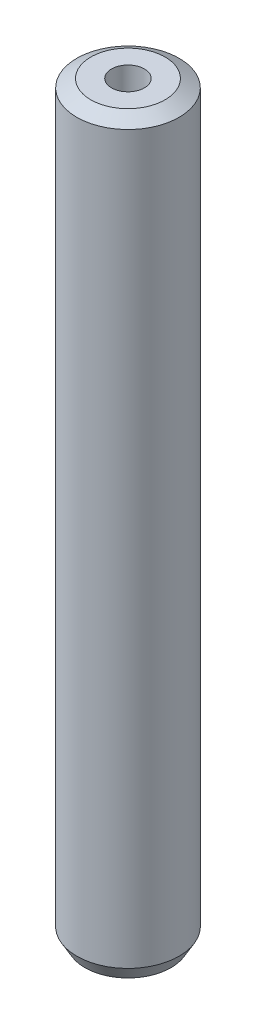
ISO-10303-21;
HEADER;
FILE_DESCRIPTION(('STEP AP214'),'2;1');
FILE_NAME('part.step','',(''),(''),'','','');
FILE_SCHEMA(('AUTOMOTIVE_DESIGN { 1 0 10303 214 1 1 1 1 }'));
ENDSEC;
DATA;
#1=APPLICATION_CONTEXT('core data for automotive mechanical design processes');
#2=APPLICATION_PROTOCOL_DEFINITION('international standard','automotive_design',2000,#1);
#3=PRODUCT_CONTEXT('',#1,'mechanical');
#4=PRODUCT('Part','Part','',(#3));
#5=PRODUCT_RELATED_PRODUCT_CATEGORY('part','',(#4));
#6=PRODUCT_DEFINITION_FORMATION('','',#4);
#7=PRODUCT_DEFINITION_CONTEXT('part definition',#1,'design');
#8=PRODUCT_DEFINITION('design','',#6,#7);
#9=PRODUCT_DEFINITION_SHAPE('','',#8);
#10=(LENGTH_UNIT() NAMED_UNIT(*) SI_UNIT(.MILLI.,.METRE.));
#11=(NAMED_UNIT(*) PLANE_ANGLE_UNIT() SI_UNIT($,.RADIAN.));
#12=(NAMED_UNIT(*) SI_UNIT($,.STERADIAN.) SOLID_ANGLE_UNIT());
#13=UNCERTAINTY_MEASURE_WITH_UNIT(LENGTH_MEASURE(1.E-05),#10,'distance_accuracy_value','');
#14=(GEOMETRIC_REPRESENTATION_CONTEXT(3) GLOBAL_UNCERTAINTY_ASSIGNED_CONTEXT((#13)) GLOBAL_UNIT_ASSIGNED_CONTEXT((#10,
#11,#12)) REPRESENTATION_CONTEXT('',''));
#15=CARTESIAN_POINT('',(0.,0.,0.));
#16=DIRECTION('',(0.,0.,1.));
#17=DIRECTION('',(1.,0.,0.));
#18=AXIS2_PLACEMENT_3D('',#15,#16,#17);
#19=CARTESIAN_POINT('',(0.,365.803524565101,0.));
#20=DIRECTION('',(0.,-1.,0.));
#21=DIRECTION('',(0.,0.,-1.));
#22=AXIS2_PLACEMENT_3D('',#19,#20,#21);
#23=CYLINDRICAL_SURFACE('',#22,25.);
#24=CARTESIAN_POINT('',(0.,361.839839552045,0.));
#25=DIRECTION('',(0.,1.,0.));
#26=DIRECTION('',(0.,0.,1.));
#27=AXIS2_PLACEMENT_3D('',#24,#25,#26);
#28=CIRCLE('',#27,25.);
#29=CARTESIAN_POINT('',(0.,361.839839552045,25.));
#30=VERTEX_POINT('',#29);
#31=EDGE_CURVE('E50',#30,#30,#28,.F.);
#32=ORIENTED_EDGE('',*,*,#31,.T.);
#33=EDGE_LOOP('',(#32));
#34=FACE_BOUND('',#33,.T.);
#35=CARTESIAN_POINT('',(0.,6.86530382781253,0.));
#36=DIRECTION('',(0.,1.,0.));
#37=DIRECTION('',(0.,0.,1.));
#38=AXIS2_PLACEMENT_3D('',#35,#36,#37);
#39=CIRCLE('',#38,25.);
#40=CARTESIAN_POINT('',(0.,6.86530382781253,25.));
#41=VERTEX_POINT('',#40);
#42=EDGE_CURVE('E51',#41,#41,#39,.T.);
#43=ORIENTED_EDGE('',*,*,#42,.T.);
#44=EDGE_LOOP('',(#43));
#45=FACE_BOUND('',#44,.T.);
#46=ADVANCED_FACE('F39',(#34,#45),#23,.T.);
#47=CARTESIAN_POINT('',(0.,365.803524565101,0.));
#48=DIRECTION('',(0.,1.,0.));
#49=DIRECTION('',(0.,0.,1.));
#50=AXIS2_PLACEMENT_3D('',#47,#48,#49);
#51=PLANE('',#50);
#52=CARTESIAN_POINT('',(0.,365.803524565101,0.));
#53=DIRECTION('',(0.,1.,0.));
#54=DIRECTION('',(0.,0.,1.));
#55=AXIS2_PLACEMENT_3D('',#52,#53,#54);
#56=CIRCLE('',#55,18.1346961721875);
#57=CARTESIAN_POINT('',(0.,365.803524565101,18.1346961721875));
#58=VERTEX_POINT('',#57);
#59=EDGE_CURVE('E54',#58,#58,#56,.T.);
#60=ORIENTED_EDGE('',*,*,#59,.T.);
#61=EDGE_LOOP('',(#60));
#62=FACE_BOUND('',#61,.T.);
#63=CARTESIAN_POINT('',(0.,365.803524565101,0.));
#64=DIRECTION('',(0.,1.,0.));
#65=DIRECTION('',(0.,0.,1.));
#66=AXIS2_PLACEMENT_3D('',#63,#64,#65);
#67=CIRCLE('',#66,8.03740332373562);
#68=CARTESIAN_POINT('',(0.,365.803524565101,8.03740332373562));
#69=VERTEX_POINT('',#68);
#70=EDGE_CURVE('E58',#69,#69,#67,.T.);
#71=ORIENTED_EDGE('',*,*,#70,.F.);
#72=EDGE_LOOP('',(#71));
#73=FACE_BOUND('',#72,.T.);
#74=ADVANCED_FACE('F69',(#62,#73),#51,.T.);
#75=CARTESIAN_POINT('',(0.,0.,0.));
#76=DIRECTION('',(0.,1.,0.));
#77=DIRECTION('',(0.,0.,1.));
#78=AXIS2_PLACEMENT_3D('',#75,#76,#77);
#79=PLANE('',#78);
#80=CARTESIAN_POINT('',(0.,0.,0.));
#81=DIRECTION('',(0.,1.,0.));
#82=DIRECTION('',(0.,0.,1.));
#83=AXIS2_PLACEMENT_3D('',#80,#81,#82);
#84=CIRCLE('',#83,21.0363149869439);
#85=CARTESIAN_POINT('',(0.,0.,21.0363149869439));
#86=VERTEX_POINT('',#85);
#87=EDGE_CURVE('E10',#86,#86,#84,.F.);
#88=ORIENTED_EDGE('',*,*,#87,.T.);
#89=EDGE_LOOP('',(#88));
#90=FACE_BOUND('',#89,.T.);
#91=CARTESIAN_POINT('',(0.,0.,0.));
#92=DIRECTION('',(0.,1.,0.));
#93=DIRECTION('',(0.,0.,1.));
#94=AXIS2_PLACEMENT_3D('',#91,#92,#93);
#95=CIRCLE('',#94,8.03740332373562);
#96=CARTESIAN_POINT('',(0.,0.,8.03740332373562));
#97=VERTEX_POINT('',#96);
#98=EDGE_CURVE('E63',#97,#97,#95,.T.);
#99=ORIENTED_EDGE('',*,*,#98,.T.);
#100=EDGE_LOOP('',(#99));
#101=FACE_BOUND('',#100,.T.);
#102=ADVANCED_FACE('F75',(#90,#101),#79,.F.);
#103=CARTESIAN_POINT('',(0.,365.803524565101,0.));
#104=DIRECTION('',(0.,-1.,0.));
#105=DIRECTION('',(0.,0.,-1.));
#106=AXIS2_PLACEMENT_3D('',#103,#104,#105);
#107=CYLINDRICAL_SURFACE('',#106,8.03740332373562);
#108=ORIENTED_EDGE('',*,*,#70,.T.);
#109=EDGE_LOOP('',(#108));
#110=FACE_BOUND('',#109,.T.);
#111=ORIENTED_EDGE('',*,*,#98,.F.);
#112=EDGE_LOOP('',(#111));
#113=FACE_BOUND('',#112,.T.);
#114=ADVANCED_FACE('F70',(#110,#113),#107,.F.);
#115=CARTESIAN_POINT('',(0.,365.803524565101,0.));
#116=DIRECTION('',(0.,-1.,0.));
#117=DIRECTION('',(0.,0.,-1.));
#118=AXIS2_PLACEMENT_3D('',#115,#116,#117);
#119=CONICAL_SURFACE('',#118,18.1346961721875,1.04719755119659);
#120=ORIENTED_EDGE('',*,*,#31,.F.);
#121=EDGE_LOOP('',(#120));
#122=FACE_BOUND('',#121,.T.);
#123=ORIENTED_EDGE('',*,*,#59,.F.);
#124=EDGE_LOOP('',(#123));
#125=FACE_BOUND('',#124,.T.);
#126=ADVANCED_FACE('F81',(#122,#125),#119,.T.);
#127=CARTESIAN_POINT('',(0.,6.86530382781253,0.));
#128=DIRECTION('',(0.,1.,0.));
#129=DIRECTION('',(0.,0.,1.));
#130=AXIS2_PLACEMENT_3D('',#127,#128,#129);
#131=CONICAL_SURFACE('',#130,25.,0.5235987755983);
#132=ORIENTED_EDGE('',*,*,#87,.F.);
#133=EDGE_LOOP('',(#132));
#134=FACE_BOUND('',#133,.T.);
#135=ORIENTED_EDGE('',*,*,#42,.F.);
#136=EDGE_LOOP('',(#135));
#137=FACE_BOUND('',#136,.T.);
#138=ADVANCED_FACE('F45',(#134,#137),#131,.T.);
#139=CLOSED_SHELL('',(#46,#74,#102,#114,#126,#138));
#140=MANIFOLD_SOLID_BREP('B2',#139);
#141=ADVANCED_BREP_SHAPE_REPRESENTATION('',(#18,#140),#14);
#142=SHAPE_DEFINITION_REPRESENTATION(#9,#141);
ENDSEC;
END-ISO-10303-21;
